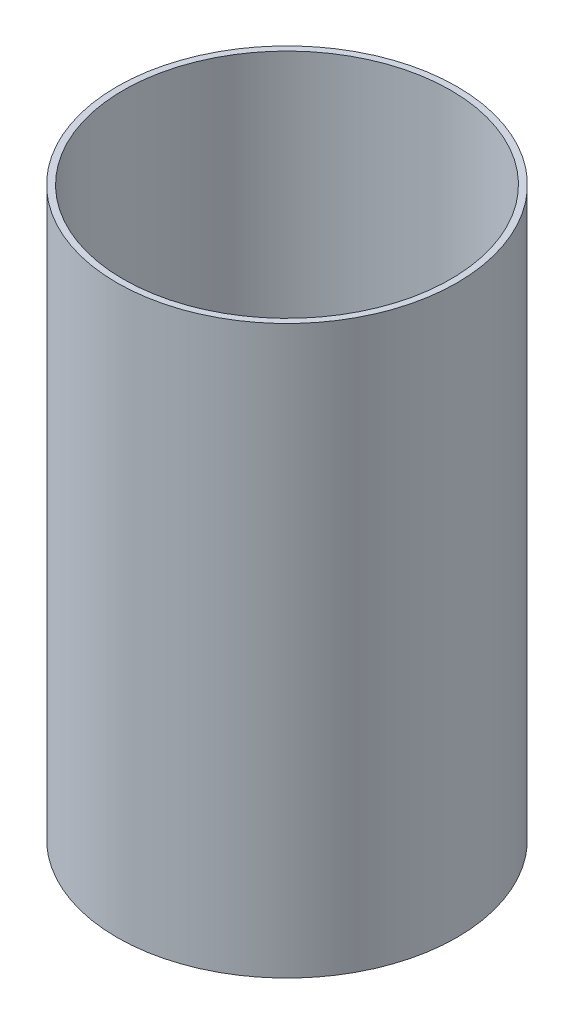
ISO-10303-21;
HEADER;
FILE_DESCRIPTION(('STEP AP214'),'2;1');
FILE_NAME('part.step','',(''),(''),'','','');
FILE_SCHEMA(('AUTOMOTIVE_DESIGN { 1 0 10303 214 1 1 1 1 }'));
ENDSEC;
DATA;
#1=APPLICATION_CONTEXT('core data for automotive mechanical design processes');
#2=APPLICATION_PROTOCOL_DEFINITION('international standard','automotive_design',2000,#1);
#3=PRODUCT_CONTEXT('',#1,'mechanical');
#4=PRODUCT('Part','Part','',(#3));
#5=PRODUCT_RELATED_PRODUCT_CATEGORY('part','',(#4));
#6=PRODUCT_DEFINITION_FORMATION('','',#4);
#7=PRODUCT_DEFINITION_CONTEXT('part definition',#1,'design');
#8=PRODUCT_DEFINITION('design','',#6,#7);
#9=PRODUCT_DEFINITION_SHAPE('','',#8);
#10=(LENGTH_UNIT() NAMED_UNIT(*) SI_UNIT(.MILLI.,.METRE.));
#11=(NAMED_UNIT(*) PLANE_ANGLE_UNIT() SI_UNIT($,.RADIAN.));
#12=(NAMED_UNIT(*) SI_UNIT($,.STERADIAN.) SOLID_ANGLE_UNIT());
#13=UNCERTAINTY_MEASURE_WITH_UNIT(LENGTH_MEASURE(1.E-05),#10,'distance_accuracy_value','');
#14=(GEOMETRIC_REPRESENTATION_CONTEXT(3) GLOBAL_UNCERTAINTY_ASSIGNED_CONTEXT((#13)) GLOBAL_UNIT_ASSIGNED_CONTEXT((#10,
#11,#12)) REPRESENTATION_CONTEXT('',''));
#15=CARTESIAN_POINT('',(0.,0.,0.));
#16=DIRECTION('',(0.,0.,1.));
#17=DIRECTION('',(1.,0.,0.));
#18=AXIS2_PLACEMENT_3D('',#15,#16,#17);
#19=CARTESIAN_POINT('',(0.,254.,0.));
#20=DIRECTION('',(0.,1.,0.));
#21=DIRECTION('',(0.,0.,1.));
#22=AXIS2_PLACEMENT_3D('',#19,#20,#21);
#23=PLANE('',#22);
#24=CARTESIAN_POINT('',(0.,254.,0.));
#25=DIRECTION('',(0.,1.,0.));
#26=DIRECTION('',(0.,0.,1.));
#27=AXIS2_PLACEMENT_3D('',#24,#25,#26);
#28=CIRCLE('',#27,76.1746);
#29=CARTESIAN_POINT('',(0.,254.,76.1746));
#30=VERTEX_POINT('',#29);
#31=EDGE_CURVE('E10',#30,#30,#28,.T.);
#32=ORIENTED_EDGE('',*,*,#31,.T.);
#33=EDGE_LOOP('',(#32));
#34=FACE_BOUND('',#33,.T.);
#35=CARTESIAN_POINT('',(0.,254.,0.));
#36=DIRECTION('',(0.,1.,0.));
#37=DIRECTION('',(0.,0.,1.));
#38=AXIS2_PLACEMENT_3D('',#35,#36,#37);
#39=CIRCLE('',#38,73.3425);
#40=CARTESIAN_POINT('',(0.,254.,73.3425));
#41=VERTEX_POINT('',#40);
#42=EDGE_CURVE('E48',#41,#41,#39,.T.);
#43=ORIENTED_EDGE('',*,*,#42,.F.);
#44=EDGE_LOOP('',(#43));
#45=FACE_BOUND('',#44,.T.);
#46=ADVANCED_FACE('F37',(#34,#45),#23,.T.);
#47=CARTESIAN_POINT('',(0.,0.,0.));
#48=DIRECTION('',(0.,1.,0.));
#49=DIRECTION('',(0.,0.,1.));
#50=AXIS2_PLACEMENT_3D('',#47,#48,#49);
#51=PLANE('',#50);
#52=CARTESIAN_POINT('',(0.,0.,0.));
#53=DIRECTION('',(0.,1.,0.));
#54=DIRECTION('',(0.,0.,1.));
#55=AXIS2_PLACEMENT_3D('',#52,#53,#54);
#56=CIRCLE('',#55,76.1746);
#57=CARTESIAN_POINT('',(0.,0.,76.1746));
#58=VERTEX_POINT('',#57);
#59=EDGE_CURVE('E41',#58,#58,#56,.T.);
#60=ORIENTED_EDGE('',*,*,#59,.F.);
#61=EDGE_LOOP('',(#60));
#62=FACE_BOUND('',#61,.T.);
#63=CARTESIAN_POINT('',(0.,0.,0.));
#64=DIRECTION('',(0.,1.,0.));
#65=DIRECTION('',(0.,0.,1.));
#66=AXIS2_PLACEMENT_3D('',#63,#64,#65);
#67=CIRCLE('',#66,73.3425);
#68=CARTESIAN_POINT('',(0.,0.,73.3425));
#69=VERTEX_POINT('',#68);
#70=EDGE_CURVE('E50',#69,#69,#67,.T.);
#71=ORIENTED_EDGE('',*,*,#70,.T.);
#72=EDGE_LOOP('',(#71));
#73=FACE_BOUND('',#72,.T.);
#74=ADVANCED_FACE('F60',(#62,#73),#51,.F.);
#75=CARTESIAN_POINT('',(0.,254.,0.));
#76=DIRECTION('',(0.,-1.,0.));
#77=DIRECTION('',(0.,0.,-1.));
#78=AXIS2_PLACEMENT_3D('',#75,#76,#77);
#79=CYLINDRICAL_SURFACE('',#78,76.1746);
#80=ORIENTED_EDGE('',*,*,#31,.F.);
#81=EDGE_LOOP('',(#80));
#82=FACE_BOUND('',#81,.T.);
#83=ORIENTED_EDGE('',*,*,#59,.T.);
#84=EDGE_LOOP('',(#83));
#85=FACE_BOUND('',#84,.T.);
#86=ADVANCED_FACE('F39',(#82,#85),#79,.T.);
#87=CARTESIAN_POINT('',(0.,254.,0.));
#88=DIRECTION('',(0.,-1.,0.));
#89=DIRECTION('',(0.,0.,-1.));
#90=AXIS2_PLACEMENT_3D('',#87,#88,#89);
#91=CYLINDRICAL_SURFACE('',#90,73.3425);
#92=ORIENTED_EDGE('',*,*,#42,.T.);
#93=EDGE_LOOP('',(#92));
#94=FACE_BOUND('',#93,.T.);
#95=ORIENTED_EDGE('',*,*,#70,.F.);
#96=EDGE_LOOP('',(#95));
#97=FACE_BOUND('',#96,.T.);
#98=ADVANCED_FACE('F56',(#94,#97),#91,.F.);
#99=CLOSED_SHELL('',(#46,#74,#86,#98));
#100=MANIFOLD_SOLID_BREP('B2',#99);
#101=ADVANCED_BREP_SHAPE_REPRESENTATION('',(#18,#100),#14);
#102=SHAPE_DEFINITION_REPRESENTATION(#9,#101);
ENDSEC;
END-ISO-10303-21;
